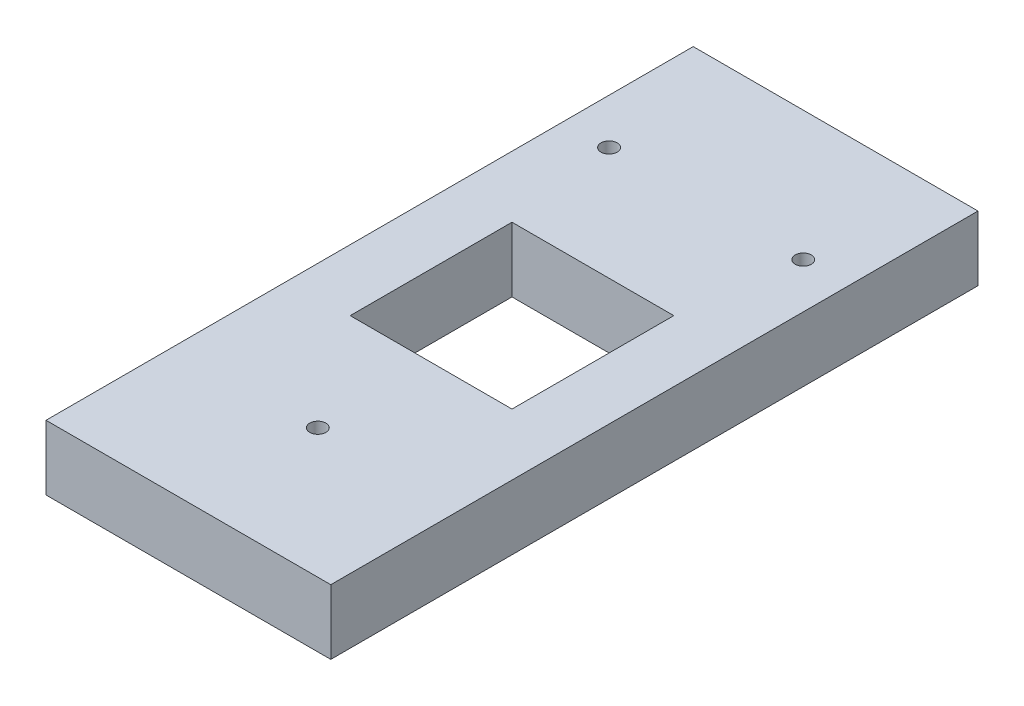
ISO-10303-21;
HEADER;
FILE_DESCRIPTION(('STEP AP214'),'2;1');
FILE_NAME('part.step','',(''),(''),'','','');
FILE_SCHEMA(('AUTOMOTIVE_DESIGN { 1 0 10303 214 1 1 1 1 }'));
ENDSEC;
DATA;
#1=APPLICATION_CONTEXT('core data for automotive mechanical design processes');
#2=APPLICATION_PROTOCOL_DEFINITION('international standard','automotive_design',2000,#1);
#3=PRODUCT_CONTEXT('',#1,'mechanical');
#4=PRODUCT('Part','Part','',(#3));
#5=PRODUCT_RELATED_PRODUCT_CATEGORY('part','',(#4));
#6=PRODUCT_DEFINITION_FORMATION('','',#4);
#7=PRODUCT_DEFINITION_CONTEXT('part definition',#1,'design');
#8=PRODUCT_DEFINITION('design','',#6,#7);
#9=PRODUCT_DEFINITION_SHAPE('','',#8);
#10=(LENGTH_UNIT() NAMED_UNIT(*) SI_UNIT(.MILLI.,.METRE.));
#11=(NAMED_UNIT(*) PLANE_ANGLE_UNIT() SI_UNIT($,.RADIAN.));
#12=(NAMED_UNIT(*) SI_UNIT($,.STERADIAN.) SOLID_ANGLE_UNIT());
#13=UNCERTAINTY_MEASURE_WITH_UNIT(LENGTH_MEASURE(1.E-05),#10,'distance_accuracy_value','');
#14=(GEOMETRIC_REPRESENTATION_CONTEXT(3) GLOBAL_UNCERTAINTY_ASSIGNED_CONTEXT((#13)) GLOBAL_UNIT_ASSIGNED_CONTEXT((#10,
#11,#12)) REPRESENTATION_CONTEXT('',''));
#15=CARTESIAN_POINT('',(0.,0.,0.));
#16=DIRECTION('',(0.,0.,1.));
#17=DIRECTION('',(1.,0.,0.));
#18=AXIS2_PLACEMENT_3D('',#15,#16,#17);
#19=CARTESIAN_POINT('',(-55.88,12.7,-127.));
#20=DIRECTION('',(1.,0.,0.));
#21=DIRECTION('',(0.,0.,-1.));
#22=AXIS2_PLACEMENT_3D('',#19,#20,#21);
#23=PLANE('',#22);
#24=DIRECTION('',(0.,0.,1.));
#25=VECTOR('',#24,1.);
#26=CARTESIAN_POINT('',(-55.88,-12.7,-127.));
#27=LINE('',#26,#25);
#28=CARTESIAN_POINT('',(-55.88,-12.7,-127.));
#29=VERTEX_POINT('',#28);
#30=CARTESIAN_POINT('',(-55.88,-12.7,127.));
#31=VERTEX_POINT('',#30);
#32=EDGE_CURVE('E133',#29,#31,#27,.T.);
#33=ORIENTED_EDGE('',*,*,#32,.T.);
#34=DIRECTION('',(0.,-1.,0.));
#35=VECTOR('',#34,1.);
#36=CARTESIAN_POINT('',(-55.88,12.7,127.));
#37=LINE('',#36,#35);
#38=CARTESIAN_POINT('',(-55.88,12.7,127.));
#39=VERTEX_POINT('',#38);
#40=EDGE_CURVE('E11',#39,#31,#37,.T.);
#41=ORIENTED_EDGE('',*,*,#40,.F.);
#42=DIRECTION('',(0.,0.,1.));
#43=VECTOR('',#42,1.);
#44=CARTESIAN_POINT('',(-55.88,12.7,-127.));
#45=LINE('',#44,#43);
#46=CARTESIAN_POINT('',(-55.88,12.7,-127.));
#47=VERTEX_POINT('',#46);
#48=EDGE_CURVE('E137',#47,#39,#45,.T.);
#49=ORIENTED_EDGE('',*,*,#48,.F.);
#50=DIRECTION('',(0.,-1.,0.));
#51=VECTOR('',#50,1.);
#52=CARTESIAN_POINT('',(-55.88,12.7,-127.));
#53=LINE('',#52,#51);
#54=EDGE_CURVE('E147',#47,#29,#53,.T.);
#55=ORIENTED_EDGE('',*,*,#54,.T.);
#56=EDGE_LOOP('',(#33,#41,#49,#55));
#57=FACE_BOUND('',#56,.T.);
#58=ADVANCED_FACE('F33',(#57),#23,.F.);
#59=CARTESIAN_POINT('',(-55.88,12.7,127.));
#60=DIRECTION('',(0.,0.,-1.));
#61=DIRECTION('',(-1.,0.,0.));
#62=AXIS2_PLACEMENT_3D('',#59,#60,#61);
#63=PLANE('',#62);
#64=DIRECTION('',(1.,0.,0.));
#65=VECTOR('',#64,1.);
#66=CARTESIAN_POINT('',(-55.88,-12.7,127.));
#67=LINE('',#66,#65);
#68=CARTESIAN_POINT('',(55.88,-12.7,127.));
#69=VERTEX_POINT('',#68);
#70=EDGE_CURVE('E150',#31,#69,#67,.T.);
#71=ORIENTED_EDGE('',*,*,#70,.T.);
#72=DIRECTION('',(0.,-1.,0.));
#73=VECTOR('',#72,1.);
#74=CARTESIAN_POINT('',(55.88,12.7,127.));
#75=LINE('',#74,#73);
#76=CARTESIAN_POINT('',(55.88,12.7,127.));
#77=VERTEX_POINT('',#76);
#78=EDGE_CURVE('E40',#77,#69,#75,.T.);
#79=ORIENTED_EDGE('',*,*,#78,.F.);
#80=DIRECTION('',(1.,0.,0.));
#81=VECTOR('',#80,1.);
#82=CARTESIAN_POINT('',(-55.88,12.7,127.));
#83=LINE('',#82,#81);
#84=EDGE_CURVE('E140',#39,#77,#83,.T.);
#85=ORIENTED_EDGE('',*,*,#84,.F.);
#86=ORIENTED_EDGE('',*,*,#40,.T.);
#87=EDGE_LOOP('',(#71,#79,#85,#86));
#88=FACE_BOUND('',#87,.T.);
#89=ADVANCED_FACE('F178',(#88),#63,.F.);
#90=CARTESIAN_POINT('',(55.88,12.7,-127.));
#91=DIRECTION('',(-1.,0.,0.));
#92=DIRECTION('',(0.,0.,1.));
#93=AXIS2_PLACEMENT_3D('',#90,#91,#92);
#94=PLANE('',#93);
#95=DIRECTION('',(0.,0.,-1.));
#96=VECTOR('',#95,1.);
#97=CARTESIAN_POINT('',(55.88,-12.7,-127.));
#98=LINE('',#97,#96);
#99=CARTESIAN_POINT('',(55.88,-12.7,-127.));
#100=VERTEX_POINT('',#99);
#101=EDGE_CURVE('E152',#69,#100,#98,.T.);
#102=ORIENTED_EDGE('',*,*,#101,.T.);
#103=DIRECTION('',(0.,-1.,0.));
#104=VECTOR('',#103,1.);
#105=CARTESIAN_POINT('',(55.88,12.7,-127.));
#106=LINE('',#105,#104);
#107=CARTESIAN_POINT('',(55.88,12.7,-127.));
#108=VERTEX_POINT('',#107);
#109=EDGE_CURVE('E157',#108,#100,#106,.T.);
#110=ORIENTED_EDGE('',*,*,#109,.F.);
#111=DIRECTION('',(0.,0.,-1.));
#112=VECTOR('',#111,1.);
#113=CARTESIAN_POINT('',(55.88,12.7,-127.));
#114=LINE('',#113,#112);
#115=EDGE_CURVE('E143',#77,#108,#114,.T.);
#116=ORIENTED_EDGE('',*,*,#115,.F.);
#117=ORIENTED_EDGE('',*,*,#78,.T.);
#118=EDGE_LOOP('',(#102,#110,#116,#117));
#119=FACE_BOUND('',#118,.T.);
#120=ADVANCED_FACE('F164',(#119),#94,.F.);
#121=CARTESIAN_POINT('',(-55.88,12.7,-127.));
#122=DIRECTION('',(0.,0.,1.));
#123=DIRECTION('',(1.,0.,0.));
#124=AXIS2_PLACEMENT_3D('',#121,#122,#123);
#125=PLANE('',#124);
#126=DIRECTION('',(-1.,0.,0.));
#127=VECTOR('',#126,1.);
#128=CARTESIAN_POINT('',(-55.88,-12.7,-127.));
#129=LINE('',#128,#127);
#130=EDGE_CURVE('E141',#100,#29,#129,.T.);
#131=ORIENTED_EDGE('',*,*,#130,.T.);
#132=ORIENTED_EDGE('',*,*,#54,.F.);
#133=DIRECTION('',(-1.,0.,0.));
#134=VECTOR('',#133,1.);
#135=CARTESIAN_POINT('',(-55.88,12.7,-127.));
#136=LINE('',#135,#134);
#137=EDGE_CURVE('E145',#108,#47,#136,.T.);
#138=ORIENTED_EDGE('',*,*,#137,.F.);
#139=ORIENTED_EDGE('',*,*,#109,.T.);
#140=EDGE_LOOP('',(#131,#132,#138,#139));
#141=FACE_BOUND('',#140,.T.);
#142=ADVANCED_FACE('F171',(#141),#125,.F.);
#143=CARTESIAN_POINT('',(0.,12.7,0.));
#144=DIRECTION('',(0.,1.,0.));
#145=DIRECTION('',(0.,0.,1.));
#146=AXIS2_PLACEMENT_3D('',#143,#144,#145);
#147=PLANE('',#146);
#148=CARTESIAN_POINT('',(-38.1,12.7,-76.2));
#149=DIRECTION('',(0.,1.,0.));
#150=DIRECTION('',(0.,0.,1.));
#151=AXIS2_PLACEMENT_3D('',#148,#149,#150);
#152=CIRCLE('',#151,3.175);
#153=CARTESIAN_POINT('',(-38.1,12.7,-73.025));
#154=VERTEX_POINT('',#153);
#155=EDGE_CURVE('E221',#154,#154,#152,.T.);
#156=ORIENTED_EDGE('',*,*,#155,.F.);
#157=EDGE_LOOP('',(#156));
#158=FACE_BOUND('',#157,.T.);
#159=CARTESIAN_POINT('',(38.1,12.7,-76.2));
#160=DIRECTION('',(0.,1.,0.));
#161=DIRECTION('',(0.,0.,1.));
#162=AXIS2_PLACEMENT_3D('',#159,#160,#161);
#163=CIRCLE('',#162,3.175);
#164=CARTESIAN_POINT('',(38.1,12.7,-73.025));
#165=VERTEX_POINT('',#164);
#166=EDGE_CURVE('E225',#165,#165,#163,.T.);
#167=ORIENTED_EDGE('',*,*,#166,.F.);
#168=EDGE_LOOP('',(#167));
#169=FACE_BOUND('',#168,.T.);
#170=CARTESIAN_POINT('',(0.,12.7,76.2));
#171=DIRECTION('',(0.,1.,0.));
#172=DIRECTION('',(0.,0.,1.));
#173=AXIS2_PLACEMENT_3D('',#170,#171,#172);
#174=CIRCLE('',#173,3.175);
#175=CARTESIAN_POINT('',(0.,12.7,79.375));
#176=VERTEX_POINT('',#175);
#177=EDGE_CURVE('E233',#176,#176,#174,.T.);
#178=ORIENTED_EDGE('',*,*,#177,.F.);
#179=EDGE_LOOP('',(#178));
#180=FACE_BOUND('',#179,.T.);
#181=DIRECTION('',(0.,0.,1.));
#182=VECTOR('',#181,1.);
#183=CARTESIAN_POINT('',(-31.75,12.7,-31.75));
#184=LINE('',#183,#182);
#185=CARTESIAN_POINT('',(-31.75,12.7,-31.75));
#186=VERTEX_POINT('',#185);
#187=CARTESIAN_POINT('',(-31.75,12.7,31.75));
#188=VERTEX_POINT('',#187);
#189=EDGE_CURVE('E47',#186,#188,#184,.T.);
#190=ORIENTED_EDGE('',*,*,#189,.F.);
#191=DIRECTION('',(-1.,0.,0.));
#192=VECTOR('',#191,1.);
#193=CARTESIAN_POINT('',(-31.75,12.7,-31.75));
#194=LINE('',#193,#192);
#195=CARTESIAN_POINT('',(31.75,12.7,-31.75));
#196=VERTEX_POINT('',#195);
#197=EDGE_CURVE('E115',#196,#186,#194,.T.);
#198=ORIENTED_EDGE('',*,*,#197,.F.);
#199=DIRECTION('',(0.,0.,-1.));
#200=VECTOR('',#199,1.);
#201=CARTESIAN_POINT('',(31.75,12.7,-31.75));
#202=LINE('',#201,#200);
#203=CARTESIAN_POINT('',(31.75,12.7,31.75));
#204=VERTEX_POINT('',#203);
#205=EDGE_CURVE('E118',#204,#196,#202,.T.);
#206=ORIENTED_EDGE('',*,*,#205,.F.);
#207=DIRECTION('',(1.,0.,0.));
#208=VECTOR('',#207,1.);
#209=CARTESIAN_POINT('',(-31.75,12.7,31.75));
#210=LINE('',#209,#208);
#211=EDGE_CURVE('E127',#188,#204,#210,.T.);
#212=ORIENTED_EDGE('',*,*,#211,.F.);
#213=EDGE_LOOP('',(#190,#198,#206,#212));
#214=FACE_BOUND('',#213,.T.);
#215=ORIENTED_EDGE('',*,*,#48,.T.);
#216=ORIENTED_EDGE('',*,*,#84,.T.);
#217=ORIENTED_EDGE('',*,*,#115,.T.);
#218=ORIENTED_EDGE('',*,*,#137,.T.);
#219=EDGE_LOOP('',(#215,#216,#217,#218));
#220=FACE_BOUND('',#219,.T.);
#221=ADVANCED_FACE('F177',(#158,#169,#180,#214,#220),#147,.T.);
#222=CARTESIAN_POINT('',(0.,-12.7,0.));
#223=DIRECTION('',(0.,1.,0.));
#224=DIRECTION('',(0.,0.,1.));
#225=AXIS2_PLACEMENT_3D('',#222,#223,#224);
#226=PLANE('',#225);
#227=CARTESIAN_POINT('',(-38.1,-12.7,-76.2));
#228=DIRECTION('',(0.,1.,0.));
#229=DIRECTION('',(0.,0.,1.));
#230=AXIS2_PLACEMENT_3D('',#227,#228,#229);
#231=CIRCLE('',#230,3.175);
#232=CARTESIAN_POINT('',(-38.1,-12.7,-73.025));
#233=VERTEX_POINT('',#232);
#234=EDGE_CURVE('E224',#233,#233,#231,.F.);
#235=ORIENTED_EDGE('',*,*,#234,.F.);
#236=EDGE_LOOP('',(#235));
#237=FACE_BOUND('',#236,.T.);
#238=CARTESIAN_POINT('',(38.1,-12.7,-76.2));
#239=DIRECTION('',(0.,1.,0.));
#240=DIRECTION('',(0.,0.,1.));
#241=AXIS2_PLACEMENT_3D('',#238,#239,#240);
#242=CIRCLE('',#241,3.175);
#243=CARTESIAN_POINT('',(38.1,-12.7,-73.025));
#244=VERTEX_POINT('',#243);
#245=EDGE_CURVE('E228',#244,#244,#242,.F.);
#246=ORIENTED_EDGE('',*,*,#245,.F.);
#247=EDGE_LOOP('',(#246));
#248=FACE_BOUND('',#247,.T.);
#249=CARTESIAN_POINT('',(0.,-12.7,76.2));
#250=DIRECTION('',(0.,1.,0.));
#251=DIRECTION('',(0.,0.,1.));
#252=AXIS2_PLACEMENT_3D('',#249,#250,#251);
#253=CIRCLE('',#252,3.175);
#254=CARTESIAN_POINT('',(0.,-12.7,79.375));
#255=VERTEX_POINT('',#254);
#256=EDGE_CURVE('E121',#255,#255,#253,.F.);
#257=ORIENTED_EDGE('',*,*,#256,.F.);
#258=EDGE_LOOP('',(#257));
#259=FACE_BOUND('',#258,.T.);
#260=DIRECTION('',(-1.,0.,0.));
#261=VECTOR('',#260,1.);
#262=CARTESIAN_POINT('',(-31.75,-12.7,-31.75));
#263=LINE('',#262,#261);
#264=CARTESIAN_POINT('',(31.75,-12.7,-31.75));
#265=VERTEX_POINT('',#264);
#266=CARTESIAN_POINT('',(-31.75,-12.7,-31.75));
#267=VERTEX_POINT('',#266);
#268=EDGE_CURVE('E105',#265,#267,#263,.T.);
#269=ORIENTED_EDGE('',*,*,#268,.T.);
#270=DIRECTION('',(0.,0.,1.));
#271=VECTOR('',#270,1.);
#272=CARTESIAN_POINT('',(-31.75,-12.7,-31.75));
#273=LINE('',#272,#271);
#274=CARTESIAN_POINT('',(-31.75,-12.7,31.75));
#275=VERTEX_POINT('',#274);
#276=EDGE_CURVE('E99',#267,#275,#273,.T.);
#277=ORIENTED_EDGE('',*,*,#276,.T.);
#278=DIRECTION('',(1.,0.,0.));
#279=VECTOR('',#278,1.);
#280=CARTESIAN_POINT('',(-31.75,-12.7,31.75));
#281=LINE('',#280,#279);
#282=CARTESIAN_POINT('',(31.75,-12.7,31.75));
#283=VERTEX_POINT('',#282);
#284=EDGE_CURVE('E108',#275,#283,#281,.T.);
#285=ORIENTED_EDGE('',*,*,#284,.T.);
#286=DIRECTION('',(0.,0.,-1.));
#287=VECTOR('',#286,1.);
#288=CARTESIAN_POINT('',(31.75,-12.7,-31.75));
#289=LINE('',#288,#287);
#290=EDGE_CURVE('E55',#283,#265,#289,.T.);
#291=ORIENTED_EDGE('',*,*,#290,.T.);
#292=EDGE_LOOP('',(#269,#277,#285,#291));
#293=FACE_BOUND('',#292,.T.);
#294=ORIENTED_EDGE('',*,*,#32,.F.);
#295=ORIENTED_EDGE('',*,*,#130,.F.);
#296=ORIENTED_EDGE('',*,*,#101,.F.);
#297=ORIENTED_EDGE('',*,*,#70,.F.);
#298=EDGE_LOOP('',(#294,#295,#296,#297));
#299=FACE_BOUND('',#298,.T.);
#300=ADVANCED_FACE('F112',(#237,#248,#259,#293,#299),#226,.F.);
#301=CARTESIAN_POINT('',(-31.75,-12.7,-31.75));
#302=DIRECTION('',(-1.,0.,0.));
#303=DIRECTION('',(0.,0.,1.));
#304=AXIS2_PLACEMENT_3D('',#301,#302,#303);
#305=PLANE('',#304);
#306=ORIENTED_EDGE('',*,*,#189,.T.);
#307=DIRECTION('',(0.,1.,0.));
#308=VECTOR('',#307,1.);
#309=CARTESIAN_POINT('',(-31.75,-12.7,31.75));
#310=LINE('',#309,#308);
#311=EDGE_CURVE('E95',#275,#188,#310,.T.);
#312=ORIENTED_EDGE('',*,*,#311,.F.);
#313=ORIENTED_EDGE('',*,*,#276,.F.);
#314=DIRECTION('',(0.,1.,0.));
#315=VECTOR('',#314,1.);
#316=CARTESIAN_POINT('',(-31.75,-12.7,-31.75));
#317=LINE('',#316,#315);
#318=EDGE_CURVE('E131',#267,#186,#317,.T.);
#319=ORIENTED_EDGE('',*,*,#318,.T.);
#320=EDGE_LOOP('',(#306,#312,#313,#319));
#321=FACE_BOUND('',#320,.T.);
#322=ADVANCED_FACE('F97',(#321),#305,.F.);
#323=CARTESIAN_POINT('',(-31.75,-12.7,-31.75));
#324=DIRECTION('',(0.,0.,-1.));
#325=DIRECTION('',(-1.,0.,0.));
#326=AXIS2_PLACEMENT_3D('',#323,#324,#325);
#327=PLANE('',#326);
#328=ORIENTED_EDGE('',*,*,#197,.T.);
#329=ORIENTED_EDGE('',*,*,#318,.F.);
#330=ORIENTED_EDGE('',*,*,#268,.F.);
#331=DIRECTION('',(0.,1.,0.));
#332=VECTOR('',#331,1.);
#333=CARTESIAN_POINT('',(31.75,-12.7,-31.75));
#334=LINE('',#333,#332);
#335=EDGE_CURVE('E134',#265,#196,#334,.T.);
#336=ORIENTED_EDGE('',*,*,#335,.T.);
#337=EDGE_LOOP('',(#328,#329,#330,#336));
#338=FACE_BOUND('',#337,.T.);
#339=ADVANCED_FACE('F196',(#338),#327,.F.);
#340=CARTESIAN_POINT('',(31.75,-12.7,-31.75));
#341=DIRECTION('',(1.,0.,0.));
#342=DIRECTION('',(0.,0.,-1.));
#343=AXIS2_PLACEMENT_3D('',#340,#341,#342);
#344=PLANE('',#343);
#345=ORIENTED_EDGE('',*,*,#205,.T.);
#346=ORIENTED_EDGE('',*,*,#335,.F.);
#347=ORIENTED_EDGE('',*,*,#290,.F.);
#348=DIRECTION('',(0.,1.,0.));
#349=VECTOR('',#348,1.);
#350=CARTESIAN_POINT('',(31.75,-12.7,31.75));
#351=LINE('',#350,#349);
#352=EDGE_CURVE('E104',#283,#204,#351,.T.);
#353=ORIENTED_EDGE('',*,*,#352,.T.);
#354=EDGE_LOOP('',(#345,#346,#347,#353));
#355=FACE_BOUND('',#354,.T.);
#356=ADVANCED_FACE('F200',(#355),#344,.F.);
#357=CARTESIAN_POINT('',(-31.75,-12.7,31.75));
#358=DIRECTION('',(0.,0.,1.));
#359=DIRECTION('',(1.,0.,0.));
#360=AXIS2_PLACEMENT_3D('',#357,#358,#359);
#361=PLANE('',#360);
#362=ORIENTED_EDGE('',*,*,#211,.T.);
#363=ORIENTED_EDGE('',*,*,#352,.F.);
#364=ORIENTED_EDGE('',*,*,#284,.F.);
#365=ORIENTED_EDGE('',*,*,#311,.T.);
#366=EDGE_LOOP('',(#362,#363,#364,#365));
#367=FACE_BOUND('',#366,.T.);
#368=ADVANCED_FACE('F109',(#367),#361,.F.);
#369=CARTESIAN_POINT('',(0.,-12.701,76.2));
#370=DIRECTION('',(0.,1.,0.));
#371=DIRECTION('',(0.,0.,1.));
#372=AXIS2_PLACEMENT_3D('',#369,#370,#371);
#373=CYLINDRICAL_SURFACE('',#372,3.175);
#374=ORIENTED_EDGE('',*,*,#177,.T.);
#375=EDGE_LOOP('',(#374));
#376=FACE_BOUND('',#375,.T.);
#377=ORIENTED_EDGE('',*,*,#256,.T.);
#378=EDGE_LOOP('',(#377));
#379=FACE_BOUND('',#378,.T.);
#380=ADVANCED_FACE('F199',(#376,#379),#373,.F.);
#381=CARTESIAN_POINT('',(38.1,-12.701,-76.2));
#382=DIRECTION('',(0.,1.,0.));
#383=DIRECTION('',(0.,0.,1.));
#384=AXIS2_PLACEMENT_3D('',#381,#382,#383);
#385=CYLINDRICAL_SURFACE('',#384,3.175);
#386=ORIENTED_EDGE('',*,*,#166,.T.);
#387=EDGE_LOOP('',(#386));
#388=FACE_BOUND('',#387,.T.);
#389=ORIENTED_EDGE('',*,*,#245,.T.);
#390=EDGE_LOOP('',(#389));
#391=FACE_BOUND('',#390,.T.);
#392=ADVANCED_FACE('F208',(#388,#391),#385,.F.);
#393=CARTESIAN_POINT('',(-38.1,-12.701,-76.2));
#394=DIRECTION('',(0.,1.,0.));
#395=DIRECTION('',(0.,0.,1.));
#396=AXIS2_PLACEMENT_3D('',#393,#394,#395);
#397=CYLINDRICAL_SURFACE('',#396,3.175);
#398=ORIENTED_EDGE('',*,*,#155,.T.);
#399=EDGE_LOOP('',(#398));
#400=FACE_BOUND('',#399,.T.);
#401=ORIENTED_EDGE('',*,*,#234,.T.);
#402=EDGE_LOOP('',(#401));
#403=FACE_BOUND('',#402,.T.);
#404=ADVANCED_FACE('F212',(#400,#403),#397,.F.);
#405=CLOSED_SHELL('',(#58,#89,#120,#142,#221,#300,#322,#339,#356,#368,#380,#392,#404));
#406=MANIFOLD_SOLID_BREP('B2',#405);
#407=ADVANCED_BREP_SHAPE_REPRESENTATION('',(#18,#406),#14);
#408=SHAPE_DEFINITION_REPRESENTATION(#9,#407);
ENDSEC;
END-ISO-10303-21;
